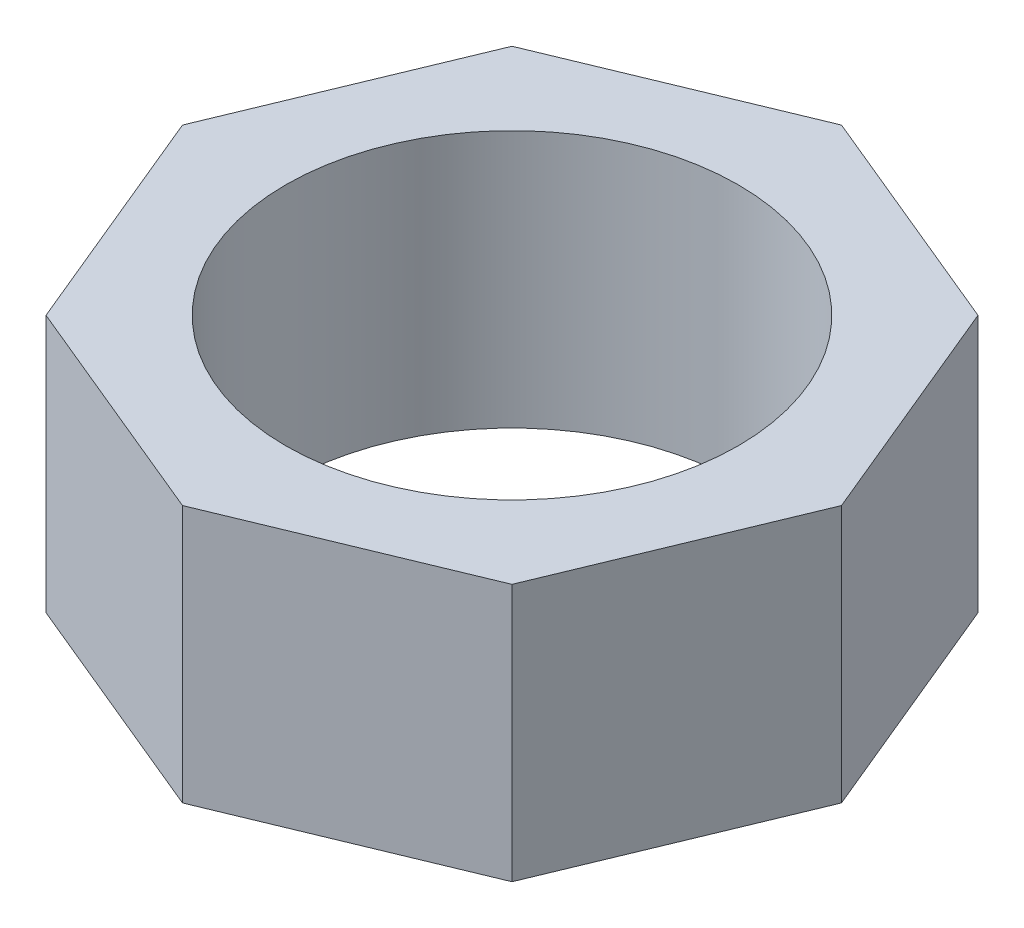
ISO-10303-21;
HEADER;
FILE_DESCRIPTION(('STEP AP214'),'2;1');
FILE_NAME('part.step','',(''),(''),'','','');
FILE_SCHEMA(('AUTOMOTIVE_DESIGN { 1 0 10303 214 1 1 1 1 }'));
ENDSEC;
DATA;
#1=APPLICATION_CONTEXT('core data for automotive mechanical design processes');
#2=APPLICATION_PROTOCOL_DEFINITION('international standard','automotive_design',2000,#1);
#3=PRODUCT_CONTEXT('',#1,'mechanical');
#4=PRODUCT('Part','Part','',(#3));
#5=PRODUCT_RELATED_PRODUCT_CATEGORY('part','',(#4));
#6=PRODUCT_DEFINITION_FORMATION('','',#4);
#7=PRODUCT_DEFINITION_CONTEXT('part definition',#1,'design');
#8=PRODUCT_DEFINITION('design','',#6,#7);
#9=PRODUCT_DEFINITION_SHAPE('','',#8);
#10=(LENGTH_UNIT() NAMED_UNIT(*) SI_UNIT(.MILLI.,.METRE.));
#11=(NAMED_UNIT(*) PLANE_ANGLE_UNIT() SI_UNIT($,.RADIAN.));
#12=(NAMED_UNIT(*) SI_UNIT($,.STERADIAN.) SOLID_ANGLE_UNIT());
#13=UNCERTAINTY_MEASURE_WITH_UNIT(LENGTH_MEASURE(1.E-05),#10,'distance_accuracy_value','');
#14=(GEOMETRIC_REPRESENTATION_CONTEXT(3) GLOBAL_UNCERTAINTY_ASSIGNED_CONTEXT((#13)) GLOBAL_UNIT_ASSIGNED_CONTEXT((#10,
#11,#12)) REPRESENTATION_CONTEXT('',''));
#15=CARTESIAN_POINT('',(0.,0.,0.));
#16=DIRECTION('',(0.,0.,1.));
#17=DIRECTION('',(1.,0.,0.));
#18=AXIS2_PLACEMENT_3D('',#15,#16,#17);
#19=CARTESIAN_POINT('',(0.,48.,0.));
#20=DIRECTION('',(0.,1.,0.));
#21=DIRECTION('',(0.,0.,1.));
#22=AXIS2_PLACEMENT_3D('',#19,#20,#21);
#23=PLANE('',#22);
#24=DIRECTION('',(0.382683432365072,0.,-0.923879532511294));
#25=VECTOR('',#24,1.);
#26=CARTESIAN_POINT('',(43.4223380280315,48.,39.9165208007097));
#27=LINE('',#26,#25);
#28=CARTESIAN_POINT('',(43.4223380280315,48.,39.9165208007097));
#29=VERTEX_POINT('',#28);
#30=CARTESIAN_POINT('',(61.4084593491896,48.,-3.50581722732055));
#31=VERTEX_POINT('',#30);
#32=EDGE_CURVE('E170',#29,#31,#27,.T.);
#33=ORIENTED_EDGE('',*,*,#32,.T.);
#34=DIRECTION('',(-0.38268343236509,0.,-0.923879532511286));
#35=VECTOR('',#34,1.);
#36=CARTESIAN_POINT('',(61.4084593491896,48.,-3.50581722732055));
#37=LINE('',#36,#35);
#38=CARTESIAN_POINT('',(43.4223380280303,48.,-46.9281552553511));
#39=VERTEX_POINT('',#38);
#40=EDGE_CURVE('E106',#31,#39,#37,.T.);
#41=ORIENTED_EDGE('',*,*,#40,.T.);
#42=DIRECTION('',(-0.92387953251129,0.,-0.382683432365081));
#43=VECTOR('',#42,1.);
#44=CARTESIAN_POINT('',(43.4223380280303,48.,-46.9281552553511));
#45=LINE('',#44,#43);
#46=CARTESIAN_POINT('',(-9.74918016590928E-13,48.,-64.9142765765101));
#47=VERTEX_POINT('',#46);
#48=EDGE_CURVE('E191',#39,#47,#45,.T.);
#49=ORIENTED_EDGE('',*,*,#48,.T.);
#50=DIRECTION('',(-0.923879532511282,0.,0.382683432365102));
#51=VECTOR('',#50,1.);
#52=CARTESIAN_POINT('',(-9.74918016590928E-13,48.,-64.9142765765101));
#53=LINE('',#52,#51);
#54=CARTESIAN_POINT('',(-43.4223380280312,48.,-46.9281552553504));
#55=VERTEX_POINT('',#54);
#56=EDGE_CURVE('E205',#47,#55,#53,.T.);
#57=ORIENTED_EDGE('',*,*,#56,.T.);
#58=DIRECTION('',(-0.382683432365082,0.,0.92387953251129));
#59=VECTOR('',#58,1.);
#60=CARTESIAN_POINT('',(-43.4223380280312,48.,-46.9281552553504));
#61=LINE('',#60,#59);
#62=CARTESIAN_POINT('',(-61.4084593491898,48.,-3.50581722732037));
#63=VERTEX_POINT('',#62);
#64=EDGE_CURVE('E125',#55,#63,#61,.T.);
#65=ORIENTED_EDGE('',*,*,#64,.T.);
#66=DIRECTION('',(0.382683432365091,0.,0.923879532511286));
#67=VECTOR('',#66,1.);
#68=CARTESIAN_POINT('',(-61.4084593491898,48.,-3.50581722732037));
#69=LINE('',#68,#67);
#70=CARTESIAN_POINT('',(-43.4223380280305,48.,39.9165208007101));
#71=VERTEX_POINT('',#70);
#72=EDGE_CURVE('E119',#63,#71,#69,.T.);
#73=ORIENTED_EDGE('',*,*,#72,.T.);
#74=DIRECTION('',(0.923879532511287,0.,0.38268343236509));
#75=VECTOR('',#74,1.);
#76=CARTESIAN_POINT('',(-43.4223380280305,48.,39.9165208007101));
#77=LINE('',#76,#75);
#78=CARTESIAN_POINT('',(1.02401028136837E-12,48.,57.9026421218698));
#79=VERTEX_POINT('',#78);
#80=EDGE_CURVE('E123',#71,#79,#77,.T.);
#81=ORIENTED_EDGE('',*,*,#80,.T.);
#82=DIRECTION('',(0.92387953251128,0.,-0.382683432365106));
#83=VECTOR('',#82,1.);
#84=CARTESIAN_POINT('',(1.02401028136837E-12,48.,57.9026421218698));
#85=LINE('',#84,#83);
#86=EDGE_CURVE('E63',#79,#29,#85,.T.);
#87=ORIENTED_EDGE('',*,*,#86,.T.);
#88=EDGE_LOOP('',(#33,#41,#49,#57,#65,#73,#81,#87));
#89=FACE_BOUND('',#88,.T.);
#90=CARTESIAN_POINT('',(0.,48.,-3.50581722732024));
#91=DIRECTION('',(0.,1.,0.));
#92=DIRECTION('',(0.,0.,1.));
#93=AXIS2_PLACEMENT_3D('',#90,#91,#92);
#94=CIRCLE('',#93,42.15);
#95=CARTESIAN_POINT('',(0.,48.,38.6441827726798));
#96=VERTEX_POINT('',#95);
#97=EDGE_CURVE('E152',#96,#96,#94,.T.);
#98=ORIENTED_EDGE('',*,*,#97,.F.);
#99=EDGE_LOOP('',(#98));
#100=FACE_BOUND('',#99,.T.);
#101=ADVANCED_FACE('F45',(#89,#100),#23,.T.);
#102=CARTESIAN_POINT('',(0.,0.,0.));
#103=DIRECTION('',(0.,1.,0.));
#104=DIRECTION('',(0.,0.,1.));
#105=AXIS2_PLACEMENT_3D('',#102,#103,#104);
#106=PLANE('',#105);
#107=DIRECTION('',(0.382683432365072,0.,-0.923879532511294));
#108=VECTOR('',#107,1.);
#109=CARTESIAN_POINT('',(43.4223380280315,0.,39.9165208007097));
#110=LINE('',#109,#108);
#111=CARTESIAN_POINT('',(43.4223380280315,0.,39.9165208007097));
#112=VERTEX_POINT('',#111);
#113=CARTESIAN_POINT('',(61.4084593491896,0.,-3.50581722732055));
#114=VERTEX_POINT('',#113);
#115=EDGE_CURVE('E147',#112,#114,#110,.T.);
#116=ORIENTED_EDGE('',*,*,#115,.F.);
#117=DIRECTION('',(0.92387953251128,0.,-0.382683432365106));
#118=VECTOR('',#117,1.);
#119=CARTESIAN_POINT('',(1.02401028136837E-12,0.,57.9026421218698));
#120=LINE('',#119,#118);
#121=CARTESIAN_POINT('',(1.02401028136837E-12,0.,57.9026421218698));
#122=VERTEX_POINT('',#121);
#123=EDGE_CURVE('E98',#122,#112,#120,.T.);
#124=ORIENTED_EDGE('',*,*,#123,.F.);
#125=DIRECTION('',(0.923879532511287,0.,0.38268343236509));
#126=VECTOR('',#125,1.);
#127=CARTESIAN_POINT('',(-43.4223380280305,0.,39.9165208007101));
#128=LINE('',#127,#126);
#129=CARTESIAN_POINT('',(-43.4223380280305,0.,39.9165208007101));
#130=VERTEX_POINT('',#129);
#131=EDGE_CURVE('E92',#130,#122,#128,.T.);
#132=ORIENTED_EDGE('',*,*,#131,.F.);
#133=DIRECTION('',(0.382683432365091,0.,0.923879532511286));
#134=VECTOR('',#133,1.);
#135=CARTESIAN_POINT('',(-61.4084593491898,0.,-3.50581722732037));
#136=LINE('',#135,#134);
#137=CARTESIAN_POINT('',(-61.4084593491898,0.,-3.50581722732037));
#138=VERTEX_POINT('',#137);
#139=EDGE_CURVE('E134',#138,#130,#136,.T.);
#140=ORIENTED_EDGE('',*,*,#139,.F.);
#141=DIRECTION('',(-0.382683432365082,0.,0.92387953251129));
#142=VECTOR('',#141,1.);
#143=CARTESIAN_POINT('',(-43.4223380280312,0.,-46.9281552553504));
#144=LINE('',#143,#142);
#145=CARTESIAN_POINT('',(-43.4223380280312,0.,-46.9281552553504));
#146=VERTEX_POINT('',#145);
#147=EDGE_CURVE('E161',#146,#138,#144,.T.);
#148=ORIENTED_EDGE('',*,*,#147,.F.);
#149=DIRECTION('',(-0.923879532511282,0.,0.382683432365102));
#150=VECTOR('',#149,1.);
#151=CARTESIAN_POINT('',(-9.74918016590928E-13,0.,-64.9142765765101));
#152=LINE('',#151,#150);
#153=CARTESIAN_POINT('',(-9.74918016590928E-13,0.,-64.9142765765101));
#154=VERTEX_POINT('',#153);
#155=EDGE_CURVE('E158',#154,#146,#152,.T.);
#156=ORIENTED_EDGE('',*,*,#155,.F.);
#157=DIRECTION('',(-0.92387953251129,0.,-0.382683432365081));
#158=VECTOR('',#157,1.);
#159=CARTESIAN_POINT('',(43.4223380280303,0.,-46.9281552553511));
#160=LINE('',#159,#158);
#161=CARTESIAN_POINT('',(43.4223380280303,0.,-46.9281552553511));
#162=VERTEX_POINT('',#161);
#163=EDGE_CURVE('E155',#162,#154,#160,.T.);
#164=ORIENTED_EDGE('',*,*,#163,.F.);
#165=DIRECTION('',(-0.38268343236509,0.,-0.923879532511286));
#166=VECTOR('',#165,1.);
#167=CARTESIAN_POINT('',(61.4084593491896,0.,-3.50581722732055));
#168=LINE('',#167,#166);
#169=EDGE_CURVE('E151',#114,#162,#168,.T.);
#170=ORIENTED_EDGE('',*,*,#169,.F.);
#171=EDGE_LOOP('',(#116,#124,#132,#140,#148,#156,#164,#170));
#172=FACE_BOUND('',#171,.T.);
#173=CARTESIAN_POINT('',(0.,0.,-3.50581722732024));
#174=DIRECTION('',(0.,1.,0.));
#175=DIRECTION('',(0.,0.,1.));
#176=AXIS2_PLACEMENT_3D('',#173,#174,#175);
#177=CIRCLE('',#176,42.15);
#178=CARTESIAN_POINT('',(0.,0.,38.6441827726798));
#179=VERTEX_POINT('',#178);
#180=EDGE_CURVE('E215',#179,#179,#177,.T.);
#181=ORIENTED_EDGE('',*,*,#180,.T.);
#182=EDGE_LOOP('',(#181));
#183=FACE_BOUND('',#182,.T.);
#184=ADVANCED_FACE('F195',(#172,#183),#106,.F.);
#185=CARTESIAN_POINT('',(43.4223380280315,48.,39.9165208007097));
#186=DIRECTION('',(-0.923879532511294,0.,-0.382683432365072));
#187=DIRECTION('',(-0.382683432365072,0.,0.923879532511294));
#188=AXIS2_PLACEMENT_3D('',#185,#186,#187);
#189=PLANE('',#188);
#190=ORIENTED_EDGE('',*,*,#115,.T.);
#191=DIRECTION('',(0.,-1.,0.));
#192=VECTOR('',#191,1.);
#193=CARTESIAN_POINT('',(61.4084593491896,48.,-3.50581722732055));
#194=LINE('',#193,#192);
#195=EDGE_CURVE('E11',#31,#114,#194,.T.);
#196=ORIENTED_EDGE('',*,*,#195,.F.);
#197=ORIENTED_EDGE('',*,*,#32,.F.);
#198=DIRECTION('',(0.,-1.,0.));
#199=VECTOR('',#198,1.);
#200=CARTESIAN_POINT('',(43.4223380280315,48.,39.9165208007097));
#201=LINE('',#200,#199);
#202=EDGE_CURVE('E143',#29,#112,#201,.T.);
#203=ORIENTED_EDGE('',*,*,#202,.T.);
#204=EDGE_LOOP('',(#190,#196,#197,#203));
#205=FACE_BOUND('',#204,.T.);
#206=ADVANCED_FACE('F47',(#205),#189,.F.);
#207=CARTESIAN_POINT('',(61.4084593491896,48.,-3.50581722732055));
#208=DIRECTION('',(-0.923879532511287,0.,0.382683432365091));
#209=DIRECTION('',(0.382683432365091,0.,0.923879532511287));
#210=AXIS2_PLACEMENT_3D('',#207,#208,#209);
#211=PLANE('',#210);
#212=ORIENTED_EDGE('',*,*,#169,.T.);
#213=DIRECTION('',(0.,-1.,0.));
#214=VECTOR('',#213,1.);
#215=CARTESIAN_POINT('',(43.4223380280303,48.,-46.9281552553511));
#216=LINE('',#215,#214);
#217=EDGE_CURVE('E55',#39,#162,#216,.T.);
#218=ORIENTED_EDGE('',*,*,#217,.F.);
#219=ORIENTED_EDGE('',*,*,#40,.F.);
#220=ORIENTED_EDGE('',*,*,#195,.T.);
#221=EDGE_LOOP('',(#212,#218,#219,#220));
#222=FACE_BOUND('',#221,.T.);
#223=ADVANCED_FACE('F245',(#222),#211,.F.);
#224=CARTESIAN_POINT('',(43.4223380280303,48.,-46.9281552553511));
#225=DIRECTION('',(-0.382683432365081,0.,0.92387953251129));
#226=DIRECTION('',(0.92387953251129,0.,0.382683432365081));
#227=AXIS2_PLACEMENT_3D('',#224,#225,#226);
#228=PLANE('',#227);
#229=ORIENTED_EDGE('',*,*,#163,.T.);
#230=DIRECTION('',(0.,-1.,0.));
#231=VECTOR('',#230,1.);
#232=CARTESIAN_POINT('',(-9.74918016590928E-13,48.,-64.9142765765101));
#233=LINE('',#232,#231);
#234=EDGE_CURVE('E181',#47,#154,#233,.T.);
#235=ORIENTED_EDGE('',*,*,#234,.F.);
#236=ORIENTED_EDGE('',*,*,#48,.F.);
#237=ORIENTED_EDGE('',*,*,#217,.T.);
#238=EDGE_LOOP('',(#229,#235,#236,#237));
#239=FACE_BOUND('',#238,.T.);
#240=ADVANCED_FACE('F189',(#239),#228,.F.);
#241=CARTESIAN_POINT('',(-9.74918016590928E-13,48.,-64.9142765765101));
#242=DIRECTION('',(0.382683432365102,0.,0.923879532511282));
#243=DIRECTION('',(0.923879532511282,0.,-0.382683432365102));
#244=AXIS2_PLACEMENT_3D('',#241,#242,#243);
#245=PLANE('',#244);
#246=ORIENTED_EDGE('',*,*,#155,.T.);
#247=DIRECTION('',(0.,-1.,0.));
#248=VECTOR('',#247,1.);
#249=CARTESIAN_POINT('',(-43.4223380280312,48.,-46.9281552553504));
#250=LINE('',#249,#248);
#251=EDGE_CURVE('E177',#55,#146,#250,.T.);
#252=ORIENTED_EDGE('',*,*,#251,.F.);
#253=ORIENTED_EDGE('',*,*,#56,.F.);
#254=ORIENTED_EDGE('',*,*,#234,.T.);
#255=EDGE_LOOP('',(#246,#252,#253,#254));
#256=FACE_BOUND('',#255,.T.);
#257=ADVANCED_FACE('F200',(#256),#245,.F.);
#258=CARTESIAN_POINT('',(-43.4223380280312,48.,-46.9281552553504));
#259=DIRECTION('',(0.92387953251129,0.,0.382683432365082));
#260=DIRECTION('',(0.382683432365082,0.,-0.92387953251129));
#261=AXIS2_PLACEMENT_3D('',#258,#259,#260);
#262=PLANE('',#261);
#263=ORIENTED_EDGE('',*,*,#147,.T.);
#264=DIRECTION('',(0.,-1.,0.));
#265=VECTOR('',#264,1.);
#266=CARTESIAN_POINT('',(-61.4084593491898,48.,-3.50581722732037));
#267=LINE('',#266,#265);
#268=EDGE_CURVE('E136',#63,#138,#267,.T.);
#269=ORIENTED_EDGE('',*,*,#268,.F.);
#270=ORIENTED_EDGE('',*,*,#64,.F.);
#271=ORIENTED_EDGE('',*,*,#251,.T.);
#272=EDGE_LOOP('',(#263,#269,#270,#271));
#273=FACE_BOUND('',#272,.T.);
#274=ADVANCED_FACE('F203',(#273),#262,.F.);
#275=CARTESIAN_POINT('',(-61.4084593491898,48.,-3.50581722732037));
#276=DIRECTION('',(0.923879532511286,0.,-0.382683432365091));
#277=DIRECTION('',(-0.382683432365091,0.,-0.923879532511286));
#278=AXIS2_PLACEMENT_3D('',#275,#276,#277);
#279=PLANE('',#278);
#280=ORIENTED_EDGE('',*,*,#139,.T.);
#281=DIRECTION('',(0.,-1.,0.));
#282=VECTOR('',#281,1.);
#283=CARTESIAN_POINT('',(-43.4223380280305,48.,39.9165208007101));
#284=LINE('',#283,#282);
#285=EDGE_CURVE('E131',#71,#130,#284,.T.);
#286=ORIENTED_EDGE('',*,*,#285,.F.);
#287=ORIENTED_EDGE('',*,*,#72,.F.);
#288=ORIENTED_EDGE('',*,*,#268,.T.);
#289=EDGE_LOOP('',(#280,#286,#287,#288));
#290=FACE_BOUND('',#289,.T.);
#291=ADVANCED_FACE('F132',(#290),#279,.F.);
#292=CARTESIAN_POINT('',(-43.4223380280305,48.,39.9165208007101));
#293=DIRECTION('',(0.38268343236509,0.,-0.923879532511287));
#294=DIRECTION('',(-0.923879532511287,0.,-0.38268343236509));
#295=AXIS2_PLACEMENT_3D('',#292,#293,#294);
#296=PLANE('',#295);
#297=ORIENTED_EDGE('',*,*,#131,.T.);
#298=DIRECTION('',(0.,-1.,0.));
#299=VECTOR('',#298,1.);
#300=CARTESIAN_POINT('',(1.02401028136837E-12,48.,57.9026421218698));
#301=LINE('',#300,#299);
#302=EDGE_CURVE('E137',#79,#122,#301,.T.);
#303=ORIENTED_EDGE('',*,*,#302,.F.);
#304=ORIENTED_EDGE('',*,*,#80,.F.);
#305=ORIENTED_EDGE('',*,*,#285,.T.);
#306=EDGE_LOOP('',(#297,#303,#304,#305));
#307=FACE_BOUND('',#306,.T.);
#308=ADVANCED_FACE('F139',(#307),#296,.F.);
#309=CARTESIAN_POINT('',(1.02401028136837E-12,48.,57.9026421218698));
#310=DIRECTION('',(-0.382683432365106,0.,-0.92387953251128));
#311=DIRECTION('',(-0.92387953251128,0.,0.382683432365106));
#312=AXIS2_PLACEMENT_3D('',#309,#310,#311);
#313=PLANE('',#312);
#314=ORIENTED_EDGE('',*,*,#123,.T.);
#315=ORIENTED_EDGE('',*,*,#202,.F.);
#316=ORIENTED_EDGE('',*,*,#86,.F.);
#317=ORIENTED_EDGE('',*,*,#302,.T.);
#318=EDGE_LOOP('',(#314,#315,#316,#317));
#319=FACE_BOUND('',#318,.T.);
#320=ADVANCED_FACE('F233',(#319),#313,.F.);
#321=CARTESIAN_POINT('',(0.,48.,-3.50581722732024));
#322=DIRECTION('',(0.,-1.,0.));
#323=DIRECTION('',(0.,0.,-1.));
#324=AXIS2_PLACEMENT_3D('',#321,#322,#323);
#325=CYLINDRICAL_SURFACE('',#324,42.15);
#326=ORIENTED_EDGE('',*,*,#97,.T.);
#327=EDGE_LOOP('',(#326));
#328=FACE_BOUND('',#327,.T.);
#329=ORIENTED_EDGE('',*,*,#180,.F.);
#330=EDGE_LOOP('',(#329));
#331=FACE_BOUND('',#330,.T.);
#332=ADVANCED_FACE('F223',(#328,#331),#325,.F.);
#333=CLOSED_SHELL('',(#101,#184,#206,#223,#240,#257,#274,#291,#308,#320,#332));
#334=MANIFOLD_SOLID_BREP('B2',#333);
#335=ADVANCED_BREP_SHAPE_REPRESENTATION('',(#18,#334),#14);
#336=SHAPE_DEFINITION_REPRESENTATION(#9,#335);
ENDSEC;
END-ISO-10303-21;
